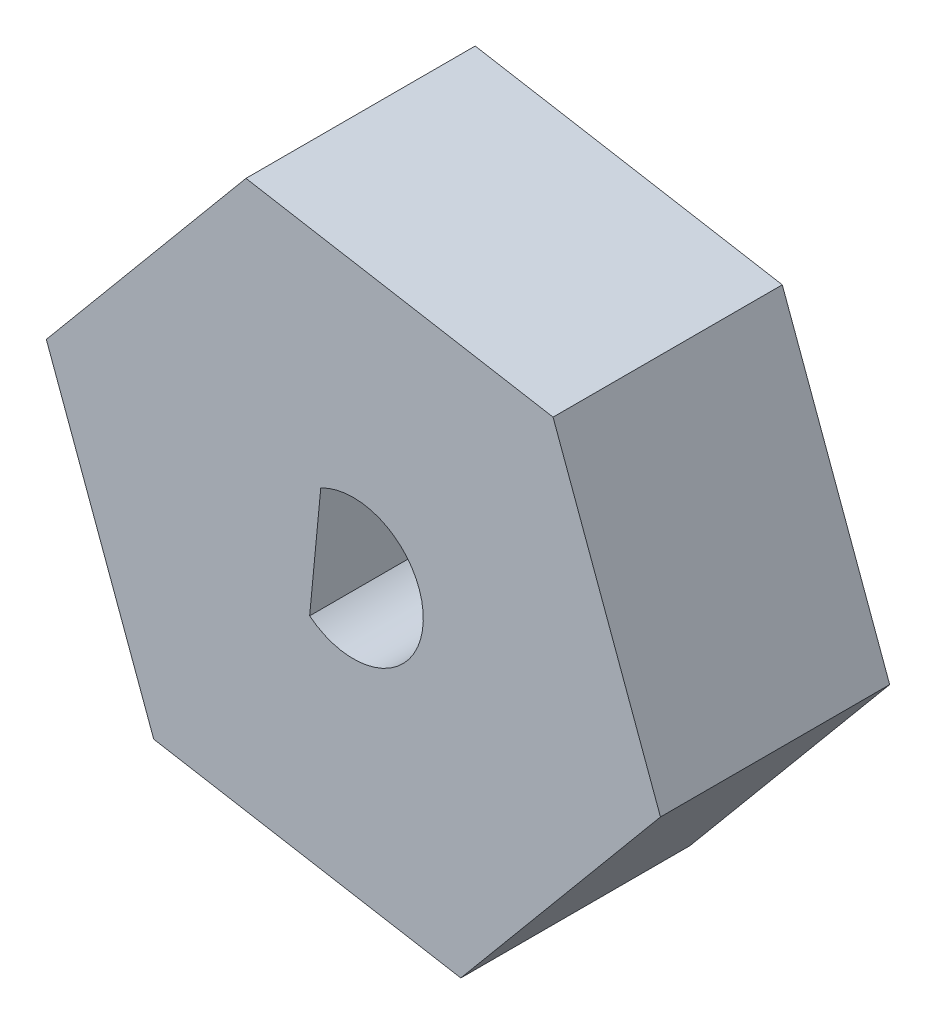
ISO-10303-21;
HEADER;
FILE_DESCRIPTION(('STEP AP214'),'2;1');
FILE_NAME('part.step','',(''),(''),'','','');
FILE_SCHEMA(('AUTOMOTIVE_DESIGN { 1 0 10303 214 1 1 1 1 }'));
ENDSEC;
DATA;
#1=APPLICATION_CONTEXT('core data for automotive mechanical design processes');
#2=APPLICATION_PROTOCOL_DEFINITION('international standard','automotive_design',2000,#1);
#3=PRODUCT_CONTEXT('',#1,'mechanical');
#4=PRODUCT('Part','Part','',(#3));
#5=PRODUCT_RELATED_PRODUCT_CATEGORY('part','',(#4));
#6=PRODUCT_DEFINITION_FORMATION('','',#4);
#7=PRODUCT_DEFINITION_CONTEXT('part definition',#1,'design');
#8=PRODUCT_DEFINITION('design','',#6,#7);
#9=PRODUCT_DEFINITION_SHAPE('','',#8);
#10=(LENGTH_UNIT() NAMED_UNIT(*) SI_UNIT(.MILLI.,.METRE.));
#11=(NAMED_UNIT(*) PLANE_ANGLE_UNIT() SI_UNIT($,.RADIAN.));
#12=(NAMED_UNIT(*) SI_UNIT($,.STERADIAN.) SOLID_ANGLE_UNIT());
#13=UNCERTAINTY_MEASURE_WITH_UNIT(LENGTH_MEASURE(1.E-05),#10,'distance_accuracy_value','');
#14=(GEOMETRIC_REPRESENTATION_CONTEXT(3) GLOBAL_UNCERTAINTY_ASSIGNED_CONTEXT((#13)) GLOBAL_UNIT_ASSIGNED_CONTEXT((#10,
#11,#12)) REPRESENTATION_CONTEXT('',''));
#15=CARTESIAN_POINT('',(0.,0.,0.));
#16=DIRECTION('',(0.,0.,1.));
#17=DIRECTION('',(1.,0.,0.));
#18=AXIS2_PLACEMENT_3D('',#15,#16,#17);
#19=CARTESIAN_POINT('',(9.12420828627685,-7.61316571257531,10.));
#20=DIRECTION('',(-0.767821387689445,0.64066396543481,0.));
#21=DIRECTION('',(-0.64066396543481,-0.767821387689445,0.));
#22=AXIS2_PLACEMENT_3D('',#19,#20,#21);
#23=PLANE('',#22);
#24=DIRECTION('',(0.64066396543481,0.767821387689445,0.));
#25=VECTOR('',#24,1.);
#26=CARTESIAN_POINT('',(9.12420828627685,-7.61316571257531,0.));
#27=LINE('',#26,#25);
#28=CARTESIAN_POINT('',(4.72874501273659,-12.8810298227991,0.));
#29=VERTEX_POINT('',#28);
#30=CARTESIAN_POINT('',(13.439595941623,-2.44127043406223,0.));
#31=VERTEX_POINT('',#30);
#32=EDGE_CURVE('E140',#29,#31,#27,.T.);
#33=ORIENTED_EDGE('',*,*,#32,.T.);
#34=DIRECTION('',(0.,0.,-1.));
#35=VECTOR('',#34,1.);
#36=CARTESIAN_POINT('',(13.439595941623,-2.44127043406223,10.));
#37=LINE('',#36,#35);
#38=CARTESIAN_POINT('',(13.439595941623,-2.44127043406223,10.));
#39=VERTEX_POINT('',#38);
#40=EDGE_CURVE('E11',#39,#31,#37,.T.);
#41=ORIENTED_EDGE('',*,*,#40,.F.);
#42=DIRECTION('',(0.64066396543481,0.767821387689445,0.));
#43=VECTOR('',#42,1.);
#44=CARTESIAN_POINT('',(9.12420828627685,-7.61316571257531,10.));
#45=LINE('',#44,#43);
#46=CARTESIAN_POINT('',(4.72874501273659,-12.8810298227991,10.));
#47=VERTEX_POINT('',#46);
#48=EDGE_CURVE('E197',#47,#39,#45,.T.);
#49=ORIENTED_EDGE('',*,*,#48,.F.);
#50=DIRECTION('',(0.,0.,-1.));
#51=VECTOR('',#50,1.);
#52=CARTESIAN_POINT('',(4.72874501273659,-12.8810298227991,10.));
#53=LINE('',#52,#51);
#54=EDGE_CURVE('E151',#47,#29,#53,.T.);
#55=ORIENTED_EDGE('',*,*,#54,.T.);
#56=EDGE_LOOP('',(#33,#41,#49,#55));
#57=FACE_BOUND('',#56,.T.);
#58=ADVANCED_FACE('F34',(#57),#23,.F.);
#59=CARTESIAN_POINT('',(11.0536866166868,4.05791044505535,10.));
#60=DIRECTION('',(-0.938741963200543,-0.344620844590675,0.));
#61=DIRECTION('',(0.344620844590675,-0.938741963200543,0.));
#62=AXIS2_PLACEMENT_3D('',#59,#60,#61);
#63=PLANE('',#62);
#64=DIRECTION('',(-0.344620844590675,0.938741963200543,0.));
#65=VECTOR('',#64,1.);
#66=CARTESIAN_POINT('',(11.0536866166868,4.05791044505535,0.));
#67=LINE('',#66,#65);
#68=CARTESIAN_POINT('',(8.75392456602296,10.3224274533011,0.));
#69=VERTEX_POINT('',#68);
#70=EDGE_CURVE('E143',#31,#69,#67,.T.);
#71=ORIENTED_EDGE('',*,*,#70,.T.);
#72=DIRECTION('',(0.,0.,-1.));
#73=VECTOR('',#72,1.);
#74=CARTESIAN_POINT('',(8.75392456602296,10.3224274533011,10.));
#75=LINE('',#74,#73);
#76=CARTESIAN_POINT('',(8.75392456602296,10.3224274533011,10.));
#77=VERTEX_POINT('',#76);
#78=EDGE_CURVE('E44',#77,#69,#75,.T.);
#79=ORIENTED_EDGE('',*,*,#78,.F.);
#80=DIRECTION('',(-0.344620844590675,0.938741963200543,0.));
#81=VECTOR('',#80,1.);
#82=CARTESIAN_POINT('',(11.0536866166868,4.05791044505535,10.));
#83=LINE('',#82,#81);
#84=EDGE_CURVE('E201',#39,#77,#83,.T.);
#85=ORIENTED_EDGE('',*,*,#84,.F.);
#86=ORIENTED_EDGE('',*,*,#40,.T.);
#87=EDGE_LOOP('',(#71,#79,#85,#86));
#88=FACE_BOUND('',#87,.T.);
#89=ADVANCED_FACE('F173',(#88),#63,.F.);
#90=CARTESIAN_POINT('',(1.99408878611399,11.4950782544767,10.));
#91=DIRECTION('',(-0.170920575511099,-0.985284810025484,0.));
#92=DIRECTION('',(0.985284810025485,-0.170920575511099,0.));
#93=AXIS2_PLACEMENT_3D('',#90,#91,#92);
#94=PLANE('',#93);
#95=DIRECTION('',(-0.985284810025484,0.170920575511099,0.));
#96=VECTOR('',#95,1.);
#97=CARTESIAN_POINT('',(1.99408878611399,11.4950782544767,0.));
#98=LINE('',#97,#96);
#99=CARTESIAN_POINT('',(-4.64259773846345,12.6463659519275,0.));
#100=VERTEX_POINT('',#99);
#101=EDGE_CURVE('E145',#69,#100,#98,.T.);
#102=ORIENTED_EDGE('',*,*,#101,.T.);
#103=DIRECTION('',(0.,0.,-1.));
#104=VECTOR('',#103,1.);
#105=CARTESIAN_POINT('',(-4.64259773846345,12.6463659519275,10.));
#106=LINE('',#105,#104);
#107=CARTESIAN_POINT('',(-4.64259773846345,12.6463659519275,10.));
#108=VERTEX_POINT('',#107);
#109=EDGE_CURVE('E125',#108,#100,#106,.T.);
#110=ORIENTED_EDGE('',*,*,#109,.F.);
#111=DIRECTION('',(-0.985284810025484,0.170920575511099,0.));
#112=VECTOR('',#111,1.);
#113=CARTESIAN_POINT('',(1.99408878611399,11.4950782544767,10.));
#114=LINE('',#113,#112);
#115=EDGE_CURVE('E116',#77,#108,#114,.T.);
#116=ORIENTED_EDGE('',*,*,#115,.F.);
#117=ORIENTED_EDGE('',*,*,#78,.T.);
#118=EDGE_LOOP('',(#102,#110,#116,#117));
#119=FACE_BOUND('',#118,.T.);
#120=ADVANCED_FACE('F179',(#119),#94,.F.);
#121=CARTESIAN_POINT('',(-8.95798539380958,7.47447067341446,10.));
#122=DIRECTION('',(0.767821387689445,-0.64066396543481,0.));
#123=DIRECTION('',(0.64066396543481,0.767821387689445,0.));
#124=AXIS2_PLACEMENT_3D('',#121,#122,#123);
#125=PLANE('',#124);
#126=DIRECTION('',(-0.64066396543481,-0.767821387689445,0.));
#127=VECTOR('',#126,1.);
#128=CARTESIAN_POINT('',(-8.95798539380958,7.47447067341446,0.));
#129=LINE('',#128,#127);
#130=CARTESIAN_POINT('',(-13.3534486673498,2.20660656319069,0.));
#131=VERTEX_POINT('',#130);
#132=EDGE_CURVE('E124',#100,#131,#129,.T.);
#133=ORIENTED_EDGE('',*,*,#132,.T.);
#134=DIRECTION('',(0.,0.,-1.));
#135=VECTOR('',#134,1.);
#136=CARTESIAN_POINT('',(-13.3534486673498,2.20660656319069,10.));
#137=LINE('',#136,#135);
#138=CARTESIAN_POINT('',(-13.3534486673498,2.20660656319069,10.));
#139=VERTEX_POINT('',#138);
#140=EDGE_CURVE('E121',#139,#131,#137,.T.);
#141=ORIENTED_EDGE('',*,*,#140,.F.);
#142=DIRECTION('',(-0.64066396543481,-0.767821387689445,0.));
#143=VECTOR('',#142,1.);
#144=CARTESIAN_POINT('',(-8.95798539380958,7.47447067341446,10.));
#145=LINE('',#144,#143);
#146=EDGE_CURVE('E110',#108,#139,#145,.T.);
#147=ORIENTED_EDGE('',*,*,#146,.F.);
#148=ORIENTED_EDGE('',*,*,#109,.T.);
#149=EDGE_LOOP('',(#133,#141,#147,#148));
#150=FACE_BOUND('',#149,.T.);
#151=ADVANCED_FACE('F122',(#150),#125,.F.);
#152=CARTESIAN_POINT('',(-11.053686616686,-4.05791044505504,10.));
#153=DIRECTION('',(0.938741963200543,0.344620844590675,0.));
#154=DIRECTION('',(-0.344620844590675,0.938741963200543,0.));
#155=AXIS2_PLACEMENT_3D('',#152,#153,#154);
#156=PLANE('',#155);
#157=DIRECTION('',(0.344620844590675,-0.938741963200543,0.));
#158=VECTOR('',#157,1.);
#159=CARTESIAN_POINT('',(-11.053686616686,-4.05791044505504,0.));
#160=LINE('',#159,#158);
#161=CARTESIAN_POINT('',(-8.66777729174982,-10.5570913241726,0.));
#162=VERTEX_POINT('',#161);
#163=EDGE_CURVE('E82',#131,#162,#160,.T.);
#164=ORIENTED_EDGE('',*,*,#163,.T.);
#165=DIRECTION('',(0.,0.,-1.));
#166=VECTOR('',#165,1.);
#167=CARTESIAN_POINT('',(-8.66777729174982,-10.5570913241726,10.));
#168=LINE('',#167,#166);
#169=CARTESIAN_POINT('',(-8.66777729174982,-10.5570913241726,10.));
#170=VERTEX_POINT('',#169);
#171=EDGE_CURVE('E126',#170,#162,#168,.T.);
#172=ORIENTED_EDGE('',*,*,#171,.F.);
#173=DIRECTION('',(0.344620844590675,-0.938741963200543,0.));
#174=VECTOR('',#173,1.);
#175=CARTESIAN_POINT('',(-11.053686616686,-4.05791044505504,10.));
#176=LINE('',#175,#174);
#177=EDGE_CURVE('E114',#139,#170,#176,.T.);
#178=ORIENTED_EDGE('',*,*,#177,.F.);
#179=ORIENTED_EDGE('',*,*,#140,.T.);
#180=EDGE_LOOP('',(#164,#172,#178,#179));
#181=FACE_BOUND('',#180,.T.);
#182=ADVANCED_FACE('F128',(#181),#156,.F.);
#183=CARTESIAN_POINT('',(0.043073637136569,-0.117331935435767,10.));
#184=DIRECTION('',(0.,0.,-1.));
#185=DIRECTION('',(-1.,0.,0.));
#186=AXIS2_PLACEMENT_3D('',#183,#184,#185);
#187=CYLINDRICAL_SURFACE('',#186,3.05);
#188=CARTESIAN_POINT('',(0.043073637136569,-0.117331935435767,0.));
#189=DIRECTION('',(0.,0.,1.));
#190=DIRECTION('',(1.,0.,0.));
#191=AXIS2_PLACEMENT_3D('',#188,#189,#190);
#192=CIRCLE('',#191,3.05);
#193=CARTESIAN_POINT('',(-1.86540252345937,-2.4964533582381,0.));
#194=VERTEX_POINT('',#193);
#195=CARTESIAN_POINT('',(-1.37989095316016,2.58038409386785,0.));
#196=VERTEX_POINT('',#195);
#197=EDGE_CURVE('E134',#194,#196,#192,.T.);
#198=ORIENTED_EDGE('',*,*,#197,.F.);
#199=DIRECTION('',(0.,0.,-1.));
#200=VECTOR('',#199,1.);
#201=CARTESIAN_POINT('',(-1.86540252345937,-2.4964533582381,10.));
#202=LINE('',#201,#200);
#203=CARTESIAN_POINT('',(-1.86540252345937,-2.4964533582381,10.));
#204=VERTEX_POINT('',#203);
#205=EDGE_CURVE('E38',#204,#194,#202,.T.);
#206=ORIENTED_EDGE('',*,*,#205,.F.);
#207=CARTESIAN_POINT('',(0.043073637136569,-0.117331935435767,10.));
#208=DIRECTION('',(0.,0.,1.));
#209=DIRECTION('',(1.,0.,0.));
#210=AXIS2_PLACEMENT_3D('',#207,#208,#209);
#211=CIRCLE('',#210,3.05);
#212=CARTESIAN_POINT('',(-1.37989095316016,2.58038409386785,10.));
#213=VERTEX_POINT('',#212);
#214=EDGE_CURVE('E150',#204,#213,#211,.T.);
#215=ORIENTED_EDGE('',*,*,#214,.T.);
#216=DIRECTION('',(0.,0.,-1.));
#217=VECTOR('',#216,1.);
#218=CARTESIAN_POINT('',(-1.37989095316016,2.58038409386785,10.));
#219=LINE('',#218,#217);
#220=EDGE_CURVE('E130',#213,#196,#219,.T.);
#221=ORIENTED_EDGE('',*,*,#220,.T.);
#222=EDGE_LOOP('',(#198,#206,#215,#221));
#223=FACE_BOUND('',#222,.T.);
#224=ADVANCED_FACE('F36',(#223),#187,.F.);
#225=CARTESIAN_POINT('',(-1.61191802617488,0.154152040411918,10.));
#226=DIRECTION('',(-0.995458323942342,0.095198347117493,0.));
#227=DIRECTION('',(-0.095198347117493,-0.995458323942342,0.));
#228=AXIS2_PLACEMENT_3D('',#225,#226,#227);
#229=PLANE('',#228);
#230=DIRECTION('',(0.095198347117493,0.995458323942342,0.));
#231=VECTOR('',#230,1.);
#232=CARTESIAN_POINT('',(-1.61191802617488,0.154152040411918,0.));
#233=LINE('',#232,#231);
#234=EDGE_CURVE('E137',#194,#196,#233,.T.);
#235=ORIENTED_EDGE('',*,*,#234,.T.);
#236=ORIENTED_EDGE('',*,*,#220,.F.);
#237=DIRECTION('',(0.095198347117493,0.995458323942342,0.));
#238=VECTOR('',#237,1.);
#239=CARTESIAN_POINT('',(-1.61191802617488,0.154152040411918,10.));
#240=LINE('',#239,#238);
#241=EDGE_CURVE('E160',#204,#213,#240,.T.);
#242=ORIENTED_EDGE('',*,*,#241,.F.);
#243=ORIENTED_EDGE('',*,*,#205,.T.);
#244=EDGE_LOOP('',(#235,#236,#242,#243));
#245=FACE_BOUND('',#244,.T.);
#246=ADVANCED_FACE('F159',(#245),#229,.F.);
#247=CARTESIAN_POINT('',(-2.03109076717238,-11.7083790216235,10.));
#248=DIRECTION('',(0.170920575511098,0.985284810025484,0.));
#249=DIRECTION('',(-0.985284810025485,0.170920575511098,0.));
#250=AXIS2_PLACEMENT_3D('',#247,#248,#249);
#251=PLANE('',#250);
#252=DIRECTION('',(0.985284810025484,-0.170920575511098,0.));
#253=VECTOR('',#252,1.);
#254=CARTESIAN_POINT('',(-2.03109076717238,-11.7083790216235,0.));
#255=LINE('',#254,#253);
#256=EDGE_CURVE('E88',#162,#29,#255,.T.);
#257=ORIENTED_EDGE('',*,*,#256,.T.);
#258=ORIENTED_EDGE('',*,*,#54,.F.);
#259=DIRECTION('',(0.985284810025484,-0.170920575511098,0.));
#260=VECTOR('',#259,1.);
#261=CARTESIAN_POINT('',(-2.03109076717238,-11.7083790216235,10.));
#262=LINE('',#261,#260);
#263=EDGE_CURVE('E53',#170,#47,#262,.T.);
#264=ORIENTED_EDGE('',*,*,#263,.F.);
#265=ORIENTED_EDGE('',*,*,#171,.T.);
#266=EDGE_LOOP('',(#257,#258,#264,#265));
#267=FACE_BOUND('',#266,.T.);
#268=ADVANCED_FACE('F170',(#267),#251,.F.);
#269=CARTESIAN_POINT('',(0.,0.,10.));
#270=DIRECTION('',(0.,0.,1.));
#271=DIRECTION('',(1.,0.,0.));
#272=AXIS2_PLACEMENT_3D('',#269,#270,#271);
#273=PLANE('',#272);
#274=ORIENTED_EDGE('',*,*,#214,.F.);
#275=ORIENTED_EDGE('',*,*,#241,.T.);
#276=EDGE_LOOP('',(#274,#275));
#277=FACE_BOUND('',#276,.T.);
#278=ORIENTED_EDGE('',*,*,#48,.T.);
#279=ORIENTED_EDGE('',*,*,#84,.T.);
#280=ORIENTED_EDGE('',*,*,#115,.T.);
#281=ORIENTED_EDGE('',*,*,#146,.T.);
#282=ORIENTED_EDGE('',*,*,#177,.T.);
#283=ORIENTED_EDGE('',*,*,#263,.T.);
#284=EDGE_LOOP('',(#278,#279,#280,#281,#282,#283));
#285=FACE_BOUND('',#284,.T.);
#286=ADVANCED_FACE('F112',(#277,#285),#273,.T.);
#287=CARTESIAN_POINT('',(0.,0.,0.));
#288=DIRECTION('',(0.,0.,1.));
#289=DIRECTION('',(1.,0.,0.));
#290=AXIS2_PLACEMENT_3D('',#287,#288,#289);
#291=PLANE('',#290);
#292=ORIENTED_EDGE('',*,*,#197,.T.);
#293=ORIENTED_EDGE('',*,*,#234,.F.);
#294=EDGE_LOOP('',(#292,#293));
#295=FACE_BOUND('',#294,.T.);
#296=ORIENTED_EDGE('',*,*,#32,.F.);
#297=ORIENTED_EDGE('',*,*,#256,.F.);
#298=ORIENTED_EDGE('',*,*,#163,.F.);
#299=ORIENTED_EDGE('',*,*,#132,.F.);
#300=ORIENTED_EDGE('',*,*,#101,.F.);
#301=ORIENTED_EDGE('',*,*,#70,.F.);
#302=EDGE_LOOP('',(#296,#297,#298,#299,#300,#301));
#303=FACE_BOUND('',#302,.T.);
#304=ADVANCED_FACE('F163',(#295,#303),#291,.F.);
#305=CLOSED_SHELL('',(#58,#89,#120,#151,#182,#224,#246,#268,#286,#304));
#306=MANIFOLD_SOLID_BREP('B2',#305);
#307=ADVANCED_BREP_SHAPE_REPRESENTATION('',(#18,#306),#14);
#308=SHAPE_DEFINITION_REPRESENTATION(#9,#307);
ENDSEC;
END-ISO-10303-21;
